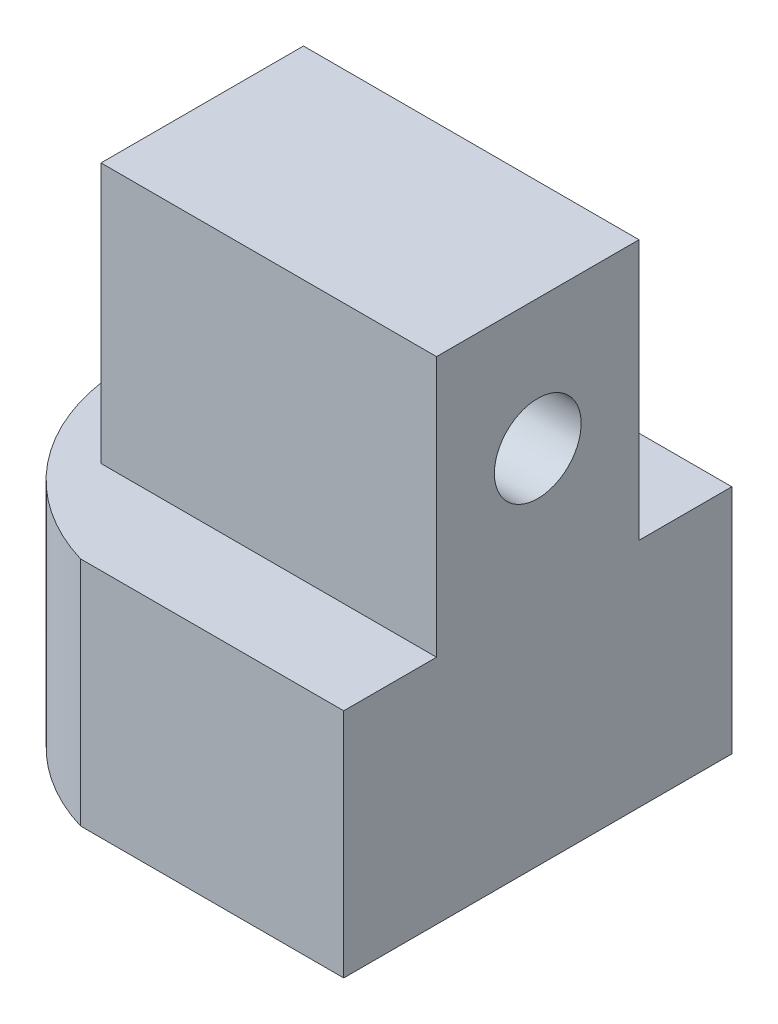
ISO-10303-21;
HEADER;
FILE_DESCRIPTION(('STEP AP214'),'2;1');
FILE_NAME('part.step','',(''),(''),'','','');
FILE_SCHEMA(('AUTOMOTIVE_DESIGN { 1 0 10303 214 1 1 1 1 }'));
ENDSEC;
DATA;
#1=APPLICATION_CONTEXT('core data for automotive mechanical design processes');
#2=APPLICATION_PROTOCOL_DEFINITION('international standard','automotive_design',2000,#1);
#3=PRODUCT_CONTEXT('',#1,'mechanical');
#4=PRODUCT('Part','Part','',(#3));
#5=PRODUCT_RELATED_PRODUCT_CATEGORY('part','',(#4));
#6=PRODUCT_DEFINITION_FORMATION('','',#4);
#7=PRODUCT_DEFINITION_CONTEXT('part definition',#1,'design');
#8=PRODUCT_DEFINITION('design','',#6,#7);
#9=PRODUCT_DEFINITION_SHAPE('','',#8);
#10=(LENGTH_UNIT() NAMED_UNIT(*) SI_UNIT(.MILLI.,.METRE.));
#11=(NAMED_UNIT(*) PLANE_ANGLE_UNIT() SI_UNIT($,.RADIAN.));
#12=(NAMED_UNIT(*) SI_UNIT($,.STERADIAN.) SOLID_ANGLE_UNIT());
#13=UNCERTAINTY_MEASURE_WITH_UNIT(LENGTH_MEASURE(1.E-05),#10,'distance_accuracy_value','');
#14=(GEOMETRIC_REPRESENTATION_CONTEXT(3) GLOBAL_UNCERTAINTY_ASSIGNED_CONTEXT((#13)) GLOBAL_UNIT_ASSIGNED_CONTEXT((#10,
#11,#12)) REPRESENTATION_CONTEXT('',''));
#15=CARTESIAN_POINT('',(0.,0.,0.));
#16=DIRECTION('',(0.,0.,1.));
#17=DIRECTION('',(1.,0.,0.));
#18=AXIS2_PLACEMENT_3D('',#15,#16,#17);
#19=CARTESIAN_POINT('',(0.,8.,0.));
#20=DIRECTION('',(0.,-1.,0.));
#21=DIRECTION('',(0.,0.,-1.));
#22=AXIS2_PLACEMENT_3D('',#19,#20,#21);
#23=PLANE('',#22);
#24=CARTESIAN_POINT('',(0.,8.,0.));
#25=DIRECTION('',(0.,1.,0.));
#26=DIRECTION('',(0.,0.,-1.));
#27=AXIS2_PLACEMENT_3D('',#24,#25,#26);
#28=CIRCLE('',#27,7.);
#29=CARTESIAN_POINT('',(-1.99999999999999,8.,-6.70820393249937));
#30=VERTEX_POINT('',#29);
#31=CARTESIAN_POINT('',(-1.99999999999999,8.,6.70820393249936));
#32=VERTEX_POINT('',#31);
#33=EDGE_CURVE('E147',#30,#32,#28,.T.);
#34=ORIENTED_EDGE('',*,*,#33,.T.);
#35=DIRECTION('',(1.,0.,0.));
#36=VECTOR('',#35,1.);
#37=CARTESIAN_POINT('',(2.,8.,6.70820393249937));
#38=LINE('',#37,#36);
#39=CARTESIAN_POINT('',(7.1,8.,6.70820393249937));
#40=VERTEX_POINT('',#39);
#41=EDGE_CURVE('E138',#32,#40,#38,.T.);
#42=ORIENTED_EDGE('',*,*,#41,.T.);
#43=DIRECTION('',(0.,0.,-1.));
#44=VECTOR('',#43,1.);
#45=CARTESIAN_POINT('',(7.1,8.,6.70820393249937));
#46=LINE('',#45,#44);
#47=CARTESIAN_POINT('',(7.1,8.,3.5));
#48=VERTEX_POINT('',#47);
#49=EDGE_CURVE('E249',#40,#48,#46,.T.);
#50=ORIENTED_EDGE('',*,*,#49,.T.);
#51=DIRECTION('',(1.,0.,0.));
#52=VECTOR('',#51,1.);
#53=CARTESIAN_POINT('',(-4.5,8.,3.5));
#54=LINE('',#53,#52);
#55=CARTESIAN_POINT('',(-4.5,8.,3.5));
#56=VERTEX_POINT('',#55);
#57=EDGE_CURVE('E49',#56,#48,#54,.T.);
#58=ORIENTED_EDGE('',*,*,#57,.F.);
#59=DIRECTION('',(0.,0.,1.));
#60=VECTOR('',#59,1.);
#61=CARTESIAN_POINT('',(-4.5,8.,3.5));
#62=LINE('',#61,#60);
#63=CARTESIAN_POINT('',(-4.5,8.,-3.5));
#64=VERTEX_POINT('',#63);
#65=EDGE_CURVE('E297',#64,#56,#62,.T.);
#66=ORIENTED_EDGE('',*,*,#65,.F.);
#67=DIRECTION('',(-1.,0.,0.));
#68=VECTOR('',#67,1.);
#69=CARTESIAN_POINT('',(-4.5,8.,-3.5));
#70=LINE('',#69,#68);
#71=CARTESIAN_POINT('',(7.1,8.,-3.5));
#72=VERTEX_POINT('',#71);
#73=EDGE_CURVE('E282',#72,#64,#70,.T.);
#74=ORIENTED_EDGE('',*,*,#73,.F.);
#75=CARTESIAN_POINT('',(7.1,8.,-6.70820393249937));
#76=VERTEX_POINT('',#75);
#77=EDGE_CURVE('E248',#72,#76,#46,.T.);
#78=ORIENTED_EDGE('',*,*,#77,.T.);
#79=DIRECTION('',(-1.,0.,0.));
#80=VECTOR('',#79,1.);
#81=CARTESIAN_POINT('',(7.1,8.,-6.70820393249937));
#82=LINE('',#81,#80);
#83=EDGE_CURVE('E251',#76,#30,#82,.T.);
#84=ORIENTED_EDGE('',*,*,#83,.T.);
#85=EDGE_LOOP('',(#34,#42,#50,#58,#66,#74,#78,#84));
#86=FACE_BOUND('',#85,.T.);
#87=ADVANCED_FACE('F34',(#86),#23,.F.);
#88=CARTESIAN_POINT('',(0.,0.,0.));
#89=DIRECTION('',(0.,1.,0.));
#90=DIRECTION('',(0.,0.,1.));
#91=AXIS2_PLACEMENT_3D('',#88,#89,#90);
#92=PLANE('',#91);
#93=DIRECTION('',(-1.,0.,0.));
#94=VECTOR('',#93,1.);
#95=CARTESIAN_POINT('',(2.,0.,6.70820393249937));
#96=LINE('',#95,#94);
#97=CARTESIAN_POINT('',(7.1,0.,6.70820393249937));
#98=VERTEX_POINT('',#97);
#99=CARTESIAN_POINT('',(-1.99999999999999,0.,6.70820393249936));
#100=VERTEX_POINT('',#99);
#101=EDGE_CURVE('E124',#98,#100,#96,.T.);
#102=ORIENTED_EDGE('',*,*,#101,.T.);
#103=CARTESIAN_POINT('',(0.,0.,0.));
#104=DIRECTION('',(0.,1.,0.));
#105=DIRECTION('',(0.,0.,1.));
#106=AXIS2_PLACEMENT_3D('',#103,#104,#105);
#107=CIRCLE('',#106,7.);
#108=CARTESIAN_POINT('',(-1.99999999999999,0.,-6.70820393249937));
#109=VERTEX_POINT('',#108);
#110=EDGE_CURVE('E12',#109,#100,#107,.T.);
#111=ORIENTED_EDGE('',*,*,#110,.F.);
#112=DIRECTION('',(1.,0.,0.));
#113=VECTOR('',#112,1.);
#114=CARTESIAN_POINT('',(7.1,0.,-6.70820393249937));
#115=LINE('',#114,#113);
#116=CARTESIAN_POINT('',(7.1,0.,-6.70820393249937));
#117=VERTEX_POINT('',#116);
#118=EDGE_CURVE('E132',#109,#117,#115,.T.);
#119=ORIENTED_EDGE('',*,*,#118,.T.);
#120=DIRECTION('',(0.,0.,1.));
#121=VECTOR('',#120,1.);
#122=CARTESIAN_POINT('',(7.1,0.,6.70820393249937));
#123=LINE('',#122,#121);
#124=EDGE_CURVE('E129',#117,#98,#123,.T.);
#125=ORIENTED_EDGE('',*,*,#124,.T.);
#126=EDGE_LOOP('',(#102,#111,#119,#125));
#127=FACE_BOUND('',#126,.T.);
#128=CARTESIAN_POINT('',(0.,0.,0.));
#129=DIRECTION('',(0.,1.,0.));
#130=DIRECTION('',(0.,0.,1.));
#131=AXIS2_PLACEMENT_3D('',#128,#129,#130);
#132=CIRCLE('',#131,4.);
#133=CARTESIAN_POINT('',(0.,0.,4.));
#134=VERTEX_POINT('',#133);
#135=EDGE_CURVE('E42',#134,#134,#132,.T.);
#136=ORIENTED_EDGE('',*,*,#135,.T.);
#137=EDGE_LOOP('',(#136));
#138=FACE_BOUND('',#137,.T.);
#139=ADVANCED_FACE('F126',(#127,#138),#92,.F.);
#140=CARTESIAN_POINT('',(0.,6.,0.));
#141=DIRECTION('',(0.,-1.,0.));
#142=DIRECTION('',(0.,0.,-1.));
#143=AXIS2_PLACEMENT_3D('',#140,#141,#142);
#144=CYLINDRICAL_SURFACE('',#143,7.);
#145=ORIENTED_EDGE('',*,*,#110,.T.);
#146=DIRECTION('',(0.,1.,0.));
#147=VECTOR('',#146,1.);
#148=CARTESIAN_POINT('',(-1.99999999999999,-6.40312423743285,6.70820393249936));
#149=LINE('',#148,#147);
#150=EDGE_CURVE('E135',#100,#32,#149,.T.);
#151=ORIENTED_EDGE('',*,*,#150,.T.);
#152=ORIENTED_EDGE('',*,*,#33,.F.);
#153=DIRECTION('',(0.,1.,0.));
#154=VECTOR('',#153,1.);
#155=CARTESIAN_POINT('',(-1.99999999999999,-6.40312423743285,-6.70820393249936));
#156=LINE('',#155,#154);
#157=EDGE_CURVE('E142',#109,#30,#156,.T.);
#158=ORIENTED_EDGE('',*,*,#157,.F.);
#159=EDGE_LOOP('',(#145,#151,#152,#158));
#160=FACE_BOUND('',#159,.T.);
#161=ADVANCED_FACE('F36',(#160),#144,.T.);
#162=CARTESIAN_POINT('',(0.,6.,0.));
#163=DIRECTION('',(0.,-1.,0.));
#164=DIRECTION('',(0.,0.,-1.));
#165=AXIS2_PLACEMENT_3D('',#162,#163,#164);
#166=CYLINDRICAL_SURFACE('',#165,4.);
#167=CARTESIAN_POINT('',(0.,6.,0.));
#168=DIRECTION('',(0.,1.,0.));
#169=DIRECTION('',(0.,0.,1.));
#170=AXIS2_PLACEMENT_3D('',#167,#168,#169);
#171=CIRCLE('',#170,4.);
#172=CARTESIAN_POINT('',(0.,6.,4.));
#173=VERTEX_POINT('',#172);
#174=EDGE_CURVE('E151',#173,#173,#171,.T.);
#175=ORIENTED_EDGE('',*,*,#174,.T.);
#176=EDGE_LOOP('',(#175));
#177=FACE_BOUND('',#176,.T.);
#178=ORIENTED_EDGE('',*,*,#135,.F.);
#179=EDGE_LOOP('',(#178));
#180=FACE_BOUND('',#179,.T.);
#181=ADVANCED_FACE('F159',(#177,#180),#166,.F.);
#182=CARTESIAN_POINT('',(0.,6.,0.));
#183=DIRECTION('',(0.,1.,0.));
#184=DIRECTION('',(0.,0.,1.));
#185=AXIS2_PLACEMENT_3D('',#182,#183,#184);
#186=PLANE('',#185);
#187=ORIENTED_EDGE('',*,*,#174,.F.);
#188=EDGE_LOOP('',(#187));
#189=FACE_BOUND('',#188,.T.);
#190=ADVANCED_FACE('F161',(#189),#186,.F.);
#191=CARTESIAN_POINT('',(-4.5,17.,-3.5));
#192=DIRECTION('',(0.,0.,1.));
#193=DIRECTION('',(1.,0.,0.));
#194=AXIS2_PLACEMENT_3D('',#191,#192,#193);
#195=PLANE('',#194);
#196=ORIENTED_EDGE('',*,*,#73,.T.);
#197=DIRECTION('',(0.,-1.,0.));
#198=VECTOR('',#197,1.);
#199=CARTESIAN_POINT('',(-4.5,17.,-3.5));
#200=LINE('',#199,#198);
#201=CARTESIAN_POINT('',(-4.5,17.,-3.5));
#202=VERTEX_POINT('',#201);
#203=EDGE_CURVE('E143',#202,#64,#200,.T.);
#204=ORIENTED_EDGE('',*,*,#203,.F.);
#205=DIRECTION('',(-1.,0.,0.));
#206=VECTOR('',#205,1.);
#207=CARTESIAN_POINT('',(-4.5,17.,-3.5));
#208=LINE('',#207,#206);
#209=CARTESIAN_POINT('',(7.1,17.,-3.5));
#210=VERTEX_POINT('',#209);
#211=EDGE_CURVE('E288',#210,#202,#208,.T.);
#212=ORIENTED_EDGE('',*,*,#211,.F.);
#213=DIRECTION('',(0.,1.,0.));
#214=VECTOR('',#213,1.);
#215=CARTESIAN_POINT('',(7.1,8.,-3.5));
#216=LINE('',#215,#214);
#217=EDGE_CURVE('E233',#72,#210,#216,.T.);
#218=ORIENTED_EDGE('',*,*,#217,.F.);
#219=EDGE_LOOP('',(#196,#204,#212,#218));
#220=FACE_BOUND('',#219,.T.);
#221=ADVANCED_FACE('F168',(#220),#195,.F.);
#222=CARTESIAN_POINT('',(-4.5,17.,3.5));
#223=DIRECTION('',(1.,0.,0.));
#224=DIRECTION('',(0.,0.,-1.));
#225=AXIS2_PLACEMENT_3D('',#222,#223,#224);
#226=PLANE('',#225);
#227=DIRECTION('',(0.,0.,1.));
#228=VECTOR('',#227,1.);
#229=CARTESIAN_POINT('',(-4.5,9.85,2.65));
#230=LINE('',#229,#228);
#231=CARTESIAN_POINT('',(-4.5,9.85,-2.65));
#232=VERTEX_POINT('',#231);
#233=CARTESIAN_POINT('',(-4.5,9.85,2.65));
#234=VERTEX_POINT('',#233);
#235=EDGE_CURVE('E272',#232,#234,#230,.T.);
#236=ORIENTED_EDGE('',*,*,#235,.F.);
#237=DIRECTION('',(0.,-1.,0.));
#238=VECTOR('',#237,1.);
#239=CARTESIAN_POINT('',(-4.5,9.85,-2.65));
#240=LINE('',#239,#238);
#241=CARTESIAN_POINT('',(-4.5,15.15,-2.65));
#242=VERTEX_POINT('',#241);
#243=EDGE_CURVE('E57',#242,#232,#240,.T.);
#244=ORIENTED_EDGE('',*,*,#243,.F.);
#245=DIRECTION('',(0.,0.,-1.));
#246=VECTOR('',#245,1.);
#247=CARTESIAN_POINT('',(-4.5,15.15,2.65));
#248=LINE('',#247,#246);
#249=CARTESIAN_POINT('',(-4.5,15.15,2.65));
#250=VERTEX_POINT('',#249);
#251=EDGE_CURVE('E261',#250,#242,#248,.T.);
#252=ORIENTED_EDGE('',*,*,#251,.F.);
#253=DIRECTION('',(0.,1.,0.));
#254=VECTOR('',#253,1.);
#255=CARTESIAN_POINT('',(-4.5,9.85,2.65));
#256=LINE('',#255,#254);
#257=EDGE_CURVE('E275',#234,#250,#256,.T.);
#258=ORIENTED_EDGE('',*,*,#257,.F.);
#259=EDGE_LOOP('',(#236,#244,#252,#258));
#260=FACE_BOUND('',#259,.T.);
#261=ORIENTED_EDGE('',*,*,#65,.T.);
#262=DIRECTION('',(0.,-1.,0.));
#263=VECTOR('',#262,1.);
#264=CARTESIAN_POINT('',(-4.5,17.,3.5));
#265=LINE('',#264,#263);
#266=CARTESIAN_POINT('',(-4.5,17.,3.5));
#267=VERTEX_POINT('',#266);
#268=EDGE_CURVE('E294',#267,#56,#265,.T.);
#269=ORIENTED_EDGE('',*,*,#268,.F.);
#270=DIRECTION('',(0.,0.,1.));
#271=VECTOR('',#270,1.);
#272=CARTESIAN_POINT('',(-4.5,17.,3.5));
#273=LINE('',#272,#271);
#274=EDGE_CURVE('E290',#202,#267,#273,.T.);
#275=ORIENTED_EDGE('',*,*,#274,.F.);
#276=ORIENTED_EDGE('',*,*,#203,.T.);
#277=EDGE_LOOP('',(#261,#269,#275,#276));
#278=FACE_BOUND('',#277,.T.);
#279=ADVANCED_FACE('F180',(#260,#278),#226,.F.);
#280=CARTESIAN_POINT('',(-4.5,17.,3.5));
#281=DIRECTION('',(0.,0.,-1.));
#282=DIRECTION('',(-1.,0.,0.));
#283=AXIS2_PLACEMENT_3D('',#280,#281,#282);
#284=PLANE('',#283);
#285=ORIENTED_EDGE('',*,*,#57,.T.);
#286=DIRECTION('',(0.,-1.,0.));
#287=VECTOR('',#286,1.);
#288=CARTESIAN_POINT('',(7.1,8.,3.5));
#289=LINE('',#288,#287);
#290=CARTESIAN_POINT('',(7.1,17.,3.5));
#291=VERTEX_POINT('',#290);
#292=EDGE_CURVE('E236',#291,#48,#289,.T.);
#293=ORIENTED_EDGE('',*,*,#292,.F.);
#294=DIRECTION('',(1.,0.,0.));
#295=VECTOR('',#294,1.);
#296=CARTESIAN_POINT('',(-4.5,17.,3.5));
#297=LINE('',#296,#295);
#298=EDGE_CURVE('E292',#267,#291,#297,.T.);
#299=ORIENTED_EDGE('',*,*,#298,.F.);
#300=ORIENTED_EDGE('',*,*,#268,.T.);
#301=EDGE_LOOP('',(#285,#293,#299,#300));
#302=FACE_BOUND('',#301,.T.);
#303=ADVANCED_FACE('F184',(#302),#284,.F.);
#304=CARTESIAN_POINT('',(0.,17.,0.));
#305=DIRECTION('',(0.,-1.,0.));
#306=DIRECTION('',(0.,0.,-1.));
#307=AXIS2_PLACEMENT_3D('',#304,#305,#306);
#308=PLANE('',#307);
#309=ORIENTED_EDGE('',*,*,#298,.T.);
#310=DIRECTION('',(0.,0.,1.));
#311=VECTOR('',#310,1.);
#312=CARTESIAN_POINT('',(7.1,17.,3.5));
#313=LINE('',#312,#311);
#314=EDGE_CURVE('E239',#210,#291,#313,.T.);
#315=ORIENTED_EDGE('',*,*,#314,.F.);
#316=ORIENTED_EDGE('',*,*,#211,.T.);
#317=ORIENTED_EDGE('',*,*,#274,.T.);
#318=EDGE_LOOP('',(#309,#315,#316,#317));
#319=FACE_BOUND('',#318,.T.);
#320=ADVANCED_FACE('F188',(#319),#308,.F.);
#321=CARTESIAN_POINT('',(1.5,9.85,-2.65));
#322=DIRECTION('',(0.,0.,-1.));
#323=DIRECTION('',(-1.,0.,0.));
#324=AXIS2_PLACEMENT_3D('',#321,#322,#323);
#325=PLANE('',#324);
#326=ORIENTED_EDGE('',*,*,#243,.T.);
#327=DIRECTION('',(-1.,0.,0.));
#328=VECTOR('',#327,1.);
#329=CARTESIAN_POINT('',(1.5,9.85,-2.65));
#330=LINE('',#329,#328);
#331=CARTESIAN_POINT('',(1.5,9.85,-2.65));
#332=VERTEX_POINT('',#331);
#333=EDGE_CURVE('E270',#332,#232,#330,.T.);
#334=ORIENTED_EDGE('',*,*,#333,.F.);
#335=DIRECTION('',(0.,-1.,0.));
#336=VECTOR('',#335,1.);
#337=CARTESIAN_POINT('',(1.5,9.85,-2.65));
#338=LINE('',#337,#336);
#339=CARTESIAN_POINT('',(1.5,15.15,-2.65));
#340=VERTEX_POINT('',#339);
#341=EDGE_CURVE('E257',#340,#332,#338,.T.);
#342=ORIENTED_EDGE('',*,*,#341,.F.);
#343=DIRECTION('',(-1.,0.,0.));
#344=VECTOR('',#343,1.);
#345=CARTESIAN_POINT('',(1.5,15.15,-2.65));
#346=LINE('',#345,#344);
#347=EDGE_CURVE('E280',#340,#242,#346,.T.);
#348=ORIENTED_EDGE('',*,*,#347,.T.);
#349=EDGE_LOOP('',(#326,#334,#342,#348));
#350=FACE_BOUND('',#349,.T.);
#351=ADVANCED_FACE('F191',(#350),#325,.F.);
#352=CARTESIAN_POINT('',(1.5,15.15,2.65));
#353=DIRECTION('',(0.,1.,0.));
#354=DIRECTION('',(0.,0.,1.));
#355=AXIS2_PLACEMENT_3D('',#352,#353,#354);
#356=PLANE('',#355);
#357=ORIENTED_EDGE('',*,*,#251,.T.);
#358=ORIENTED_EDGE('',*,*,#347,.F.);
#359=DIRECTION('',(0.,0.,-1.));
#360=VECTOR('',#359,1.);
#361=CARTESIAN_POINT('',(1.5,15.15,2.65));
#362=LINE('',#361,#360);
#363=CARTESIAN_POINT('',(1.5,15.15,2.65));
#364=VERTEX_POINT('',#363);
#365=EDGE_CURVE('E267',#364,#340,#362,.T.);
#366=ORIENTED_EDGE('',*,*,#365,.F.);
#367=DIRECTION('',(-1.,0.,0.));
#368=VECTOR('',#367,1.);
#369=CARTESIAN_POINT('',(1.5,15.15,2.65));
#370=LINE('',#369,#368);
#371=EDGE_CURVE('E283',#364,#250,#370,.T.);
#372=ORIENTED_EDGE('',*,*,#371,.T.);
#373=EDGE_LOOP('',(#357,#358,#366,#372));
#374=FACE_BOUND('',#373,.T.);
#375=ADVANCED_FACE('F195',(#374),#356,.F.);
#376=CARTESIAN_POINT('',(1.5,9.85,2.65));
#377=DIRECTION('',(0.,0.,1.));
#378=DIRECTION('',(1.,0.,0.));
#379=AXIS2_PLACEMENT_3D('',#376,#377,#378);
#380=PLANE('',#379);
#381=ORIENTED_EDGE('',*,*,#257,.T.);
#382=ORIENTED_EDGE('',*,*,#371,.F.);
#383=DIRECTION('',(0.,1.,0.));
#384=VECTOR('',#383,1.);
#385=CARTESIAN_POINT('',(1.5,9.85,2.65));
#386=LINE('',#385,#384);
#387=CARTESIAN_POINT('',(1.5,9.85,2.65));
#388=VERTEX_POINT('',#387);
#389=EDGE_CURVE('E264',#388,#364,#386,.T.);
#390=ORIENTED_EDGE('',*,*,#389,.F.);
#391=DIRECTION('',(-1.,0.,0.));
#392=VECTOR('',#391,1.);
#393=CARTESIAN_POINT('',(1.5,9.85,2.65));
#394=LINE('',#393,#392);
#395=EDGE_CURVE('E285',#388,#234,#394,.T.);
#396=ORIENTED_EDGE('',*,*,#395,.T.);
#397=EDGE_LOOP('',(#381,#382,#390,#396));
#398=FACE_BOUND('',#397,.T.);
#399=ADVANCED_FACE('F200',(#398),#380,.F.);
#400=CARTESIAN_POINT('',(1.5,9.85,2.65));
#401=DIRECTION('',(0.,-1.,0.));
#402=DIRECTION('',(0.,0.,-1.));
#403=AXIS2_PLACEMENT_3D('',#400,#401,#402);
#404=PLANE('',#403);
#405=ORIENTED_EDGE('',*,*,#235,.T.);
#406=ORIENTED_EDGE('',*,*,#395,.F.);
#407=DIRECTION('',(0.,0.,1.));
#408=VECTOR('',#407,1.);
#409=CARTESIAN_POINT('',(1.5,9.85,2.65));
#410=LINE('',#409,#408);
#411=EDGE_CURVE('E260',#332,#388,#410,.T.);
#412=ORIENTED_EDGE('',*,*,#411,.F.);
#413=ORIENTED_EDGE('',*,*,#333,.T.);
#414=EDGE_LOOP('',(#405,#406,#412,#413));
#415=FACE_BOUND('',#414,.T.);
#416=ADVANCED_FACE('F196',(#415),#404,.F.);
#417=CARTESIAN_POINT('',(1.5,0.,0.));
#418=DIRECTION('',(-1.,0.,0.));
#419=DIRECTION('',(0.,0.,1.));
#420=AXIS2_PLACEMENT_3D('',#417,#418,#419);
#421=PLANE('',#420);
#422=CARTESIAN_POINT('',(1.5,12.5,0.));
#423=DIRECTION('',(-1.,0.,0.));
#424=DIRECTION('',(0.,0.,1.));
#425=AXIS2_PLACEMENT_3D('',#422,#423,#424);
#426=CIRCLE('',#425,1.5);
#427=CARTESIAN_POINT('',(1.5,12.5,1.5));
#428=VERTEX_POINT('',#427);
#429=EDGE_CURVE('E231',#428,#428,#426,.T.);
#430=ORIENTED_EDGE('',*,*,#429,.F.);
#431=EDGE_LOOP('',(#430));
#432=FACE_BOUND('',#431,.T.);
#433=ORIENTED_EDGE('',*,*,#341,.T.);
#434=ORIENTED_EDGE('',*,*,#411,.T.);
#435=ORIENTED_EDGE('',*,*,#389,.T.);
#436=ORIENTED_EDGE('',*,*,#365,.T.);
#437=EDGE_LOOP('',(#433,#434,#435,#436));
#438=FACE_BOUND('',#437,.T.);
#439=ADVANCED_FACE('F199',(#432,#438),#421,.T.);
#440=CARTESIAN_POINT('',(7.1,-14.3530484566868,-6.70820393249937));
#441=DIRECTION('',(0.,0.,-1.));
#442=DIRECTION('',(-1.,0.,0.));
#443=AXIS2_PLACEMENT_3D('',#440,#441,#442);
#444=PLANE('',#443);
#445=ORIENTED_EDGE('',*,*,#118,.F.);
#446=ORIENTED_EDGE('',*,*,#157,.T.);
#447=ORIENTED_EDGE('',*,*,#83,.F.);
#448=DIRECTION('',(0.,1.,0.));
#449=VECTOR('',#448,1.);
#450=CARTESIAN_POINT('',(7.1,-14.3530484566868,-6.70820393249937));
#451=LINE('',#450,#449);
#452=EDGE_CURVE('E245',#117,#76,#451,.T.);
#453=ORIENTED_EDGE('',*,*,#452,.F.);
#454=EDGE_LOOP('',(#445,#446,#447,#453));
#455=FACE_BOUND('',#454,.T.);
#456=ADVANCED_FACE('F210',(#455),#444,.T.);
#457=CARTESIAN_POINT('',(7.1,-14.3530484566868,6.70820393249937));
#458=DIRECTION('',(1.,0.,0.));
#459=DIRECTION('',(0.,0.,-1.));
#460=AXIS2_PLACEMENT_3D('',#457,#458,#459);
#461=PLANE('',#460);
#462=CARTESIAN_POINT('',(7.1,12.5,0.));
#463=DIRECTION('',(-1.,0.,0.));
#464=DIRECTION('',(0.,0.,1.));
#465=AXIS2_PLACEMENT_3D('',#462,#463,#464);
#466=CIRCLE('',#465,1.5);
#467=CARTESIAN_POINT('',(7.1,12.5,1.5));
#468=VERTEX_POINT('',#467);
#469=EDGE_CURVE('E228',#468,#468,#466,.T.);
#470=ORIENTED_EDGE('',*,*,#469,.T.);
#471=EDGE_LOOP('',(#470));
#472=FACE_BOUND('',#471,.T.);
#473=ORIENTED_EDGE('',*,*,#124,.F.);
#474=ORIENTED_EDGE('',*,*,#452,.T.);
#475=ORIENTED_EDGE('',*,*,#77,.F.);
#476=ORIENTED_EDGE('',*,*,#217,.T.);
#477=ORIENTED_EDGE('',*,*,#314,.T.);
#478=ORIENTED_EDGE('',*,*,#292,.T.);
#479=ORIENTED_EDGE('',*,*,#49,.F.);
#480=DIRECTION('',(0.,1.,0.));
#481=VECTOR('',#480,1.);
#482=CARTESIAN_POINT('',(7.1,-14.3530484566868,6.70820393249937));
#483=LINE('',#482,#481);
#484=EDGE_CURVE('E253',#98,#40,#483,.T.);
#485=ORIENTED_EDGE('',*,*,#484,.F.);
#486=EDGE_LOOP('',(#473,#474,#475,#476,#477,#478,#479,#485));
#487=FACE_BOUND('',#486,.T.);
#488=ADVANCED_FACE('F215',(#472,#487),#461,.T.);
#489=CARTESIAN_POINT('',(2.,-14.3530484566868,6.70820393249937));
#490=DIRECTION('',(0.,0.,1.));
#491=DIRECTION('',(1.,0.,0.));
#492=AXIS2_PLACEMENT_3D('',#489,#490,#491);
#493=PLANE('',#492);
#494=ORIENTED_EDGE('',*,*,#101,.F.);
#495=ORIENTED_EDGE('',*,*,#484,.T.);
#496=ORIENTED_EDGE('',*,*,#41,.F.);
#497=ORIENTED_EDGE('',*,*,#150,.F.);
#498=EDGE_LOOP('',(#494,#495,#496,#497));
#499=FACE_BOUND('',#498,.T.);
#500=ADVANCED_FACE('F136',(#499),#493,.T.);
#501=CARTESIAN_POINT('',(7.1,12.5,0.));
#502=DIRECTION('',(-1.,0.,0.));
#503=DIRECTION('',(0.,0.,1.));
#504=AXIS2_PLACEMENT_3D('',#501,#502,#503);
#505=CYLINDRICAL_SURFACE('',#504,1.5);
#506=ORIENTED_EDGE('',*,*,#469,.F.);
#507=EDGE_LOOP('',(#506));
#508=FACE_BOUND('',#507,.T.);
#509=ORIENTED_EDGE('',*,*,#429,.T.);
#510=EDGE_LOOP('',(#509));
#511=FACE_BOUND('',#510,.T.);
#512=ADVANCED_FACE('F214',(#508,#511),#505,.F.);
#513=CLOSED_SHELL('',(#87,#139,#161,#181,#190,#221,#279,#303,#320,#351,#375,#399,#416,#439,#456,
#488,#500,#512));
#514=MANIFOLD_SOLID_BREP('B2',#513);
#515=ADVANCED_BREP_SHAPE_REPRESENTATION('',(#18,#514),#14);
#516=SHAPE_DEFINITION_REPRESENTATION(#9,#515);
ENDSEC;
END-ISO-10303-21;
